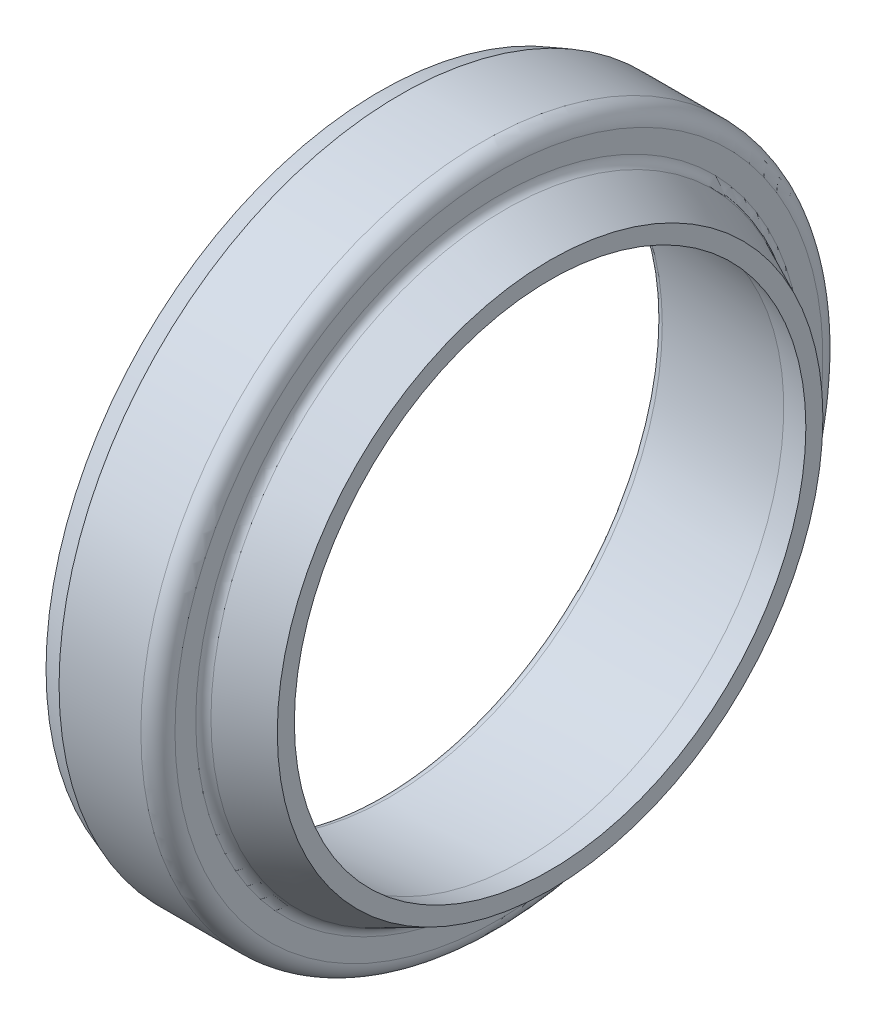
ISO-10303-21;
HEADER;
FILE_DESCRIPTION(('STEP AP214'),'2;1');
FILE_NAME('part.step','',(''),(''),'','','');
FILE_SCHEMA(('AUTOMOTIVE_DESIGN { 1 0 10303 214 1 1 1 1 }'));
ENDSEC;
DATA;
#1=APPLICATION_CONTEXT('core data for automotive mechanical design processes');
#2=APPLICATION_PROTOCOL_DEFINITION('international standard','automotive_design',2000,#1);
#3=PRODUCT_CONTEXT('',#1,'mechanical');
#4=PRODUCT('Part','Part','',(#3));
#5=PRODUCT_RELATED_PRODUCT_CATEGORY('part','',(#4));
#6=PRODUCT_DEFINITION_FORMATION('','',#4);
#7=PRODUCT_DEFINITION_CONTEXT('part definition',#1,'design');
#8=PRODUCT_DEFINITION('design','',#6,#7);
#9=PRODUCT_DEFINITION_SHAPE('','',#8);
#10=(LENGTH_UNIT() NAMED_UNIT(*) SI_UNIT(.MILLI.,.METRE.));
#11=(NAMED_UNIT(*) PLANE_ANGLE_UNIT() SI_UNIT($,.RADIAN.));
#12=(NAMED_UNIT(*) SI_UNIT($,.STERADIAN.) SOLID_ANGLE_UNIT());
#13=UNCERTAINTY_MEASURE_WITH_UNIT(LENGTH_MEASURE(1.E-05),#10,'distance_accuracy_value','');
#14=(GEOMETRIC_REPRESENTATION_CONTEXT(3) GLOBAL_UNCERTAINTY_ASSIGNED_CONTEXT((#13)) GLOBAL_UNIT_ASSIGNED_CONTEXT((#10,
#11,#12)) REPRESENTATION_CONTEXT('',''));
#15=CARTESIAN_POINT('',(0.,0.,0.));
#16=DIRECTION('',(0.,0.,1.));
#17=DIRECTION('',(1.,0.,0.));
#18=AXIS2_PLACEMENT_3D('',#15,#16,#17);
#19=CARTESIAN_POINT('',(0.,0.,0.));
#20=DIRECTION('',(-1.,0.,0.));
#21=DIRECTION('',(0.,0.,1.));
#22=AXIS2_PLACEMENT_3D('',#19,#20,#21);
#23=CONICAL_SURFACE('',#22,16.0808259377012,0.0872664625997098);
#24=CARTESIAN_POINT('',(0.547706554351407,0.,0.));
#25=DIRECTION('',(1.,0.,0.));
#26=DIRECTION('',(0.,0.,-1.));
#27=AXIS2_PLACEMENT_3D('',#24,#25,#26);
#28=CIRCLE('',#27,16.0329078232566);
#29=CARTESIAN_POINT('',(0.547706554351407,0.,-16.0329078232566));
#30=VERTEX_POINT('',#29);
#31=EDGE_CURVE('E49',#30,#30,#28,.F.);
#32=ORIENTED_EDGE('',*,*,#31,.T.);
#33=EDGE_LOOP('',(#32));
#34=FACE_BOUND('',#33,.T.);
#35=CARTESIAN_POINT('',(8.35338,0.,0.));
#36=DIRECTION('',(-1.,0.,0.));
#37=DIRECTION('',(0.,0.,1.));
#38=AXIS2_PLACEMENT_3D('',#35,#36,#37);
#39=CIRCLE('',#38,15.3499998855771);
#40=CARTESIAN_POINT('',(8.35338,0.,15.3499998855771));
#41=VERTEX_POINT('',#40);
#42=EDGE_CURVE('E72',#41,#41,#39,.T.);
#43=ORIENTED_EDGE('',*,*,#42,.F.);
#44=EDGE_LOOP('',(#43));
#45=FACE_BOUND('',#44,.T.);
#46=ADVANCED_FACE('F34',(#34,#45),#23,.F.);
#47=CARTESIAN_POINT('',(0.,16.0808259377012,0.));
#48=DIRECTION('',(1.,0.,0.));
#49=DIRECTION('',(0.,0.,-1.));
#50=AXIS2_PLACEMENT_3D('',#47,#48,#49);
#51=PLANE('',#50);
#52=CARTESIAN_POINT('',(0.,0.,0.));
#53=DIRECTION('',(1.,0.,0.));
#54=DIRECTION('',(0.,0.,-1.));
#55=AXIS2_PLACEMENT_3D('',#52,#53,#54);
#56=CIRCLE('',#55,16.6306246421117);
#57=CARTESIAN_POINT('',(0.,0.,-16.6306246421117));
#58=VERTEX_POINT('',#57);
#59=EDGE_CURVE('E45',#58,#58,#56,.T.);
#60=ORIENTED_EDGE('',*,*,#59,.T.);
#61=EDGE_LOOP('',(#60));
#62=FACE_BOUND('',#61,.T.);
#63=CARTESIAN_POINT('',(0.,0.,0.));
#64=DIRECTION('',(-1.,0.,0.));
#65=DIRECTION('',(0.,0.,1.));
#66=AXIS2_PLACEMENT_3D('',#63,#64,#65);
#67=CIRCLE('',#66,19.5632356044576);
#68=CARTESIAN_POINT('',(0.,0.,19.5632356044576));
#69=VERTEX_POINT('',#68);
#70=EDGE_CURVE('E60',#69,#69,#67,.T.);
#71=ORIENTED_EDGE('',*,*,#70,.T.);
#72=EDGE_LOOP('',(#71));
#73=FACE_BOUND('',#72,.T.);
#74=ADVANCED_FACE('F79',(#62,#73),#51,.F.);
#75=CARTESIAN_POINT('',(1.2,0.,0.));
#76=DIRECTION('',(1.,0.,0.));
#77=DIRECTION('',(0.,0.,-1.));
#78=AXIS2_PLACEMENT_3D('',#75,#76,#77);
#79=CONICAL_SURFACE('',#78,19.9999998855771,0.349065850398869);
#80=ORIENTED_EDGE('',*,*,#70,.F.);
#81=EDGE_LOOP('',(#80));
#82=FACE_BOUND('',#81,.T.);
#83=CARTESIAN_POINT('',(1.2,0.,0.));
#84=DIRECTION('',(-1.,0.,0.));
#85=DIRECTION('',(0.,0.,1.));
#86=AXIS2_PLACEMENT_3D('',#83,#84,#85);
#87=CIRCLE('',#86,19.9999998855771);
#88=CARTESIAN_POINT('',(1.2,0.,19.9999998855771));
#89=VERTEX_POINT('',#88);
#90=EDGE_CURVE('E63',#89,#89,#87,.T.);
#91=ORIENTED_EDGE('',*,*,#90,.T.);
#92=EDGE_LOOP('',(#91));
#93=FACE_BOUND('',#92,.T.);
#94=ADVANCED_FACE('F85',(#82,#93),#79,.T.);
#95=CARTESIAN_POINT('',(0.,0.,0.));
#96=DIRECTION('',(-1.,0.,0.));
#97=DIRECTION('',(0.,0.,1.));
#98=AXIS2_PLACEMENT_3D('',#95,#96,#97);
#99=CYLINDRICAL_SURFACE('',#98,19.9999998855771);
#100=CARTESIAN_POINT('',(6.,0.,0.));
#101=DIRECTION('',(-1.,0.,0.));
#102=DIRECTION('',(0.,0.,1.));
#103=AXIS2_PLACEMENT_3D('',#100,#101,#102);
#104=CIRCLE('',#103,19.9999998855771);
#105=CARTESIAN_POINT('',(6.,0.,19.9999998855771));
#106=VERTEX_POINT('',#105);
#107=EDGE_CURVE('E41',#106,#106,#104,.T.);
#108=ORIENTED_EDGE('',*,*,#107,.T.);
#109=EDGE_LOOP('',(#108));
#110=FACE_BOUND('',#109,.T.);
#111=ORIENTED_EDGE('',*,*,#90,.F.);
#112=EDGE_LOOP('',(#111));
#113=FACE_BOUND('',#112,.T.);
#114=ADVANCED_FACE('F108',(#110,#113),#99,.T.);
#115=CARTESIAN_POINT('',(7.,19.9999998855771,0.));
#116=DIRECTION('',(-1.,0.,0.));
#117=DIRECTION('',(0.,0.,1.));
#118=AXIS2_PLACEMENT_3D('',#115,#116,#117);
#119=PLANE('',#118);
#120=CARTESIAN_POINT('',(7.,0.,0.));
#121=DIRECTION('',(-1.,0.,0.));
#122=DIRECTION('',(0.,0.,1.));
#123=AXIS2_PLACEMENT_3D('',#120,#121,#122);
#124=CIRCLE('',#123,18.9999998855771);
#125=CARTESIAN_POINT('',(7.,0.,18.9999998855771));
#126=VERTEX_POINT('',#125);
#127=EDGE_CURVE('E10',#126,#126,#124,.F.);
#128=ORIENTED_EDGE('',*,*,#127,.T.);
#129=EDGE_LOOP('',(#128));
#130=FACE_BOUND('',#129,.T.);
#131=CARTESIAN_POINT('',(7.,0.,0.));
#132=DIRECTION('',(-1.,0.,0.));
#133=DIRECTION('',(0.,0.,1.));
#134=AXIS2_PLACEMENT_3D('',#131,#132,#133);
#135=CIRCLE('',#134,17.7811651309495);
#136=CARTESIAN_POINT('',(7.,0.,17.7811651309495));
#137=VERTEX_POINT('',#136);
#138=EDGE_CURVE('E57',#137,#137,#135,.T.);
#139=ORIENTED_EDGE('',*,*,#138,.T.);
#140=EDGE_LOOP('',(#139));
#141=FACE_BOUND('',#140,.T.);
#142=ADVANCED_FACE('F112',(#130,#141),#119,.F.);
#143=CARTESIAN_POINT('',(10.,0.,0.));
#144=DIRECTION('',(-1.,0.,0.));
#145=DIRECTION('',(0.,0.,1.));
#146=AXIS2_PLACEMENT_3D('',#143,#144,#145);
#147=CONICAL_SURFACE('',#146,16.,0.436332312998583);
#148=CARTESIAN_POINT('',(7.34642904295558,0.,0.));
#149=DIRECTION('',(-1.,0.,0.));
#150=DIRECTION('',(0.,0.,1.));
#151=AXIS2_PLACEMENT_3D('',#148,#149,#150);
#152=CIRCLE('',#151,17.2373804587275);
#153=CARTESIAN_POINT('',(7.34642904295558,0.,17.2373804587275));
#154=VERTEX_POINT('',#153);
#155=EDGE_CURVE('E54',#154,#154,#152,.F.);
#156=ORIENTED_EDGE('',*,*,#155,.T.);
#157=EDGE_LOOP('',(#156));
#158=FACE_BOUND('',#157,.T.);
#159=CARTESIAN_POINT('',(10.,0.,0.));
#160=DIRECTION('',(-1.,0.,0.));
#161=DIRECTION('',(0.,0.,1.));
#162=AXIS2_PLACEMENT_3D('',#159,#160,#161);
#163=CIRCLE('',#162,16.);
#164=CARTESIAN_POINT('',(10.,0.,16.));
#165=VERTEX_POINT('',#164);
#166=EDGE_CURVE('E66',#165,#165,#163,.T.);
#167=ORIENTED_EDGE('',*,*,#166,.T.);
#168=EDGE_LOOP('',(#167));
#169=FACE_BOUND('',#168,.T.);
#170=ADVANCED_FACE('F117',(#158,#169),#147,.T.);
#171=CARTESIAN_POINT('',(10.,16.,0.));
#172=DIRECTION('',(-1.,0.,0.));
#173=DIRECTION('',(0.,0.,1.));
#174=AXIS2_PLACEMENT_3D('',#171,#172,#173);
#175=PLANE('',#174);
#176=ORIENTED_EDGE('',*,*,#166,.F.);
#177=EDGE_LOOP('',(#176));
#178=FACE_BOUND('',#177,.T.);
#179=CARTESIAN_POINT('',(10.,0.,0.));
#180=DIRECTION('',(-1.,0.,0.));
#181=DIRECTION('',(0.,0.,1.));
#182=AXIS2_PLACEMENT_3D('',#179,#180,#181);
#183=CIRCLE('',#182,15.);
#184=CARTESIAN_POINT('',(10.,0.,15.));
#185=VERTEX_POINT('',#184);
#186=EDGE_CURVE('E69',#185,#185,#183,.T.);
#187=ORIENTED_EDGE('',*,*,#186,.T.);
#188=EDGE_LOOP('',(#187));
#189=FACE_BOUND('',#188,.T.);
#190=ADVANCED_FACE('F122',(#178,#189),#175,.F.);
#191=CARTESIAN_POINT('',(8.35338,0.,0.));
#192=DIRECTION('',(-1.,0.,0.));
#193=DIRECTION('',(0.,0.,1.));
#194=AXIS2_PLACEMENT_3D('',#191,#192,#193);
#195=CONICAL_SURFACE('',#194,15.3499998855771,0.209439510239313);
#196=ORIENTED_EDGE('',*,*,#186,.F.);
#197=EDGE_LOOP('',(#196));
#198=FACE_BOUND('',#197,.T.);
#199=ORIENTED_EDGE('',*,*,#42,.T.);
#200=EDGE_LOOP('',(#199));
#201=FACE_BOUND('',#200,.T.);
#202=ADVANCED_FACE('F76',(#198,#201),#195,.F.);
#203=CARTESIAN_POINT('',(7.6,0.,0.));
#204=DIRECTION('',(-1.,0.,0.));
#205=DIRECTION('',(0.,0.,1.));
#206=AXIS2_PLACEMENT_3D('',#203,#204,#205);
#207=TOROIDAL_SURFACE('',#206,17.7811651309495,0.6);
#208=ORIENTED_EDGE('',*,*,#155,.F.);
#209=EDGE_LOOP('',(#208));
#210=FACE_BOUND('',#209,.T.);
#211=ORIENTED_EDGE('',*,*,#138,.F.);
#212=EDGE_LOOP('',(#211));
#213=FACE_BOUND('',#212,.T.);
#214=ADVANCED_FACE('F90',(#210,#213),#207,.F.);
#215=CARTESIAN_POINT('',(0.6,0.,0.));
#216=DIRECTION('',(1.,0.,0.));
#217=DIRECTION('',(0.,0.,-1.));
#218=AXIS2_PLACEMENT_3D('',#215,#216,#217);
#219=TOROIDAL_SURFACE('',#218,16.6306246421117,0.6);
#220=ORIENTED_EDGE('',*,*,#59,.F.);
#221=EDGE_LOOP('',(#220));
#222=FACE_BOUND('',#221,.T.);
#223=ORIENTED_EDGE('',*,*,#31,.F.);
#224=EDGE_LOOP('',(#223));
#225=FACE_BOUND('',#224,.T.);
#226=ADVANCED_FACE('F92',(#222,#225),#219,.T.);
#227=CARTESIAN_POINT('',(6.,0.,0.));
#228=DIRECTION('',(-1.,0.,0.));
#229=DIRECTION('',(0.,0.,1.));
#230=AXIS2_PLACEMENT_3D('',#227,#228,#229);
#231=TOROIDAL_SURFACE('',#230,18.9999998855771,1.);
#232=ORIENTED_EDGE('',*,*,#127,.F.);
#233=EDGE_LOOP('',(#232));
#234=FACE_BOUND('',#233,.T.);
#235=ORIENTED_EDGE('',*,*,#107,.F.);
#236=EDGE_LOOP('',(#235));
#237=FACE_BOUND('',#236,.T.);
#238=ADVANCED_FACE('F36',(#234,#237),#231,.T.);
#239=CLOSED_SHELL('',(#46,#74,#94,#114,#142,#170,#190,#202,#214,#226,#238));
#240=MANIFOLD_SOLID_BREP('B2',#239);
#241=ADVANCED_BREP_SHAPE_REPRESENTATION('',(#18,#240),#14);
#242=SHAPE_DEFINITION_REPRESENTATION(#9,#241);
ENDSEC;
END-ISO-10303-21;
